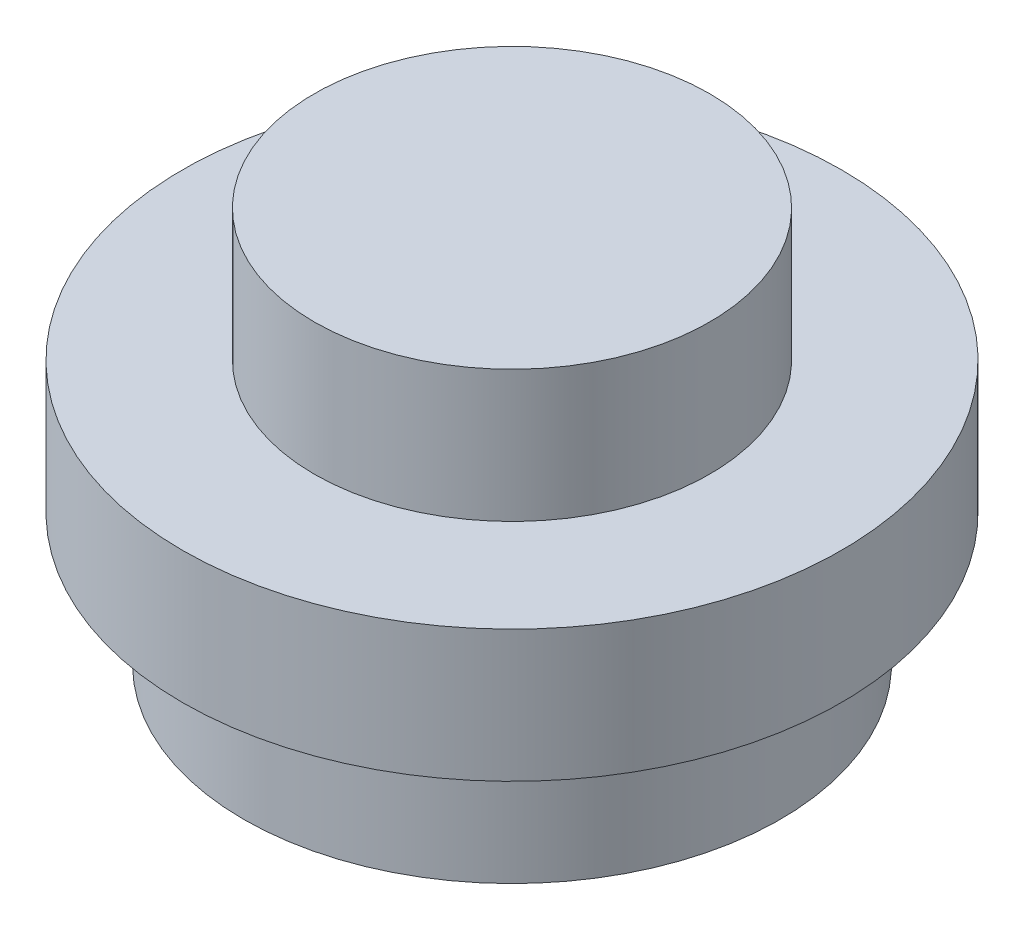
ISO-10303-21;
HEADER;
FILE_DESCRIPTION(('STEP AP214'),'2;1');
FILE_NAME('part.step','',(''),(''),'','','');
FILE_SCHEMA(('AUTOMOTIVE_DESIGN { 1 0 10303 214 1 1 1 1 }'));
ENDSEC;
DATA;
#1=APPLICATION_CONTEXT('core data for automotive mechanical design processes');
#2=APPLICATION_PROTOCOL_DEFINITION('international standard','automotive_design',2000,#1);
#3=PRODUCT_CONTEXT('',#1,'mechanical');
#4=PRODUCT('Part','Part','',(#3));
#5=PRODUCT_RELATED_PRODUCT_CATEGORY('part','',(#4));
#6=PRODUCT_DEFINITION_FORMATION('','',#4);
#7=PRODUCT_DEFINITION_CONTEXT('part definition',#1,'design');
#8=PRODUCT_DEFINITION('design','',#6,#7);
#9=PRODUCT_DEFINITION_SHAPE('','',#8);
#10=(LENGTH_UNIT() NAMED_UNIT(*) SI_UNIT(.MILLI.,.METRE.));
#11=(NAMED_UNIT(*) PLANE_ANGLE_UNIT() SI_UNIT($,.RADIAN.));
#12=(NAMED_UNIT(*) SI_UNIT($,.STERADIAN.) SOLID_ANGLE_UNIT());
#13=UNCERTAINTY_MEASURE_WITH_UNIT(LENGTH_MEASURE(1.E-05),#10,'distance_accuracy_value','');
#14=(GEOMETRIC_REPRESENTATION_CONTEXT(3) GLOBAL_UNCERTAINTY_ASSIGNED_CONTEXT((#13)) GLOBAL_UNIT_ASSIGNED_CONTEXT((#10,
#11,#12)) REPRESENTATION_CONTEXT('',''));
#15=CARTESIAN_POINT('',(0.,0.,0.));
#16=DIRECTION('',(0.,0.,1.));
#17=DIRECTION('',(1.,0.,0.));
#18=AXIS2_PLACEMENT_3D('',#15,#16,#17);
#19=CARTESIAN_POINT('',(0.,2.,0.));
#20=DIRECTION('',(0.,-1.,0.));
#21=DIRECTION('',(0.,0.,-1.));
#22=AXIS2_PLACEMENT_3D('',#19,#20,#21);
#23=CYLINDRICAL_SURFACE('',#22,1.5);
#24=CARTESIAN_POINT('',(0.,1.,0.));
#25=DIRECTION('',(0.,1.,0.));
#26=DIRECTION('',(0.,0.,1.));
#27=AXIS2_PLACEMENT_3D('',#24,#25,#26);
#28=CIRCLE('',#27,1.5);
#29=CARTESIAN_POINT('',(0.,1.,1.5));
#30=VERTEX_POINT('',#29);
#31=EDGE_CURVE('E43',#30,#30,#28,.T.);
#32=ORIENTED_EDGE('',*,*,#31,.T.);
#33=EDGE_LOOP('',(#32));
#34=FACE_BOUND('',#33,.T.);
#35=CARTESIAN_POINT('',(0.,2.,0.));
#36=DIRECTION('',(0.,1.,0.));
#37=DIRECTION('',(0.,0.,1.));
#38=AXIS2_PLACEMENT_3D('',#35,#36,#37);
#39=CIRCLE('',#38,1.5);
#40=CARTESIAN_POINT('',(0.,2.,1.5));
#41=VERTEX_POINT('',#40);
#42=EDGE_CURVE('E39',#41,#41,#39,.T.);
#43=ORIENTED_EDGE('',*,*,#42,.F.);
#44=EDGE_LOOP('',(#43));
#45=FACE_BOUND('',#44,.T.);
#46=ADVANCED_FACE('F33',(#34,#45),#23,.T.);
#47=CARTESIAN_POINT('',(0.,2.,0.));
#48=DIRECTION('',(0.,1.,0.));
#49=DIRECTION('',(0.,0.,1.));
#50=AXIS2_PLACEMENT_3D('',#47,#48,#49);
#51=PLANE('',#50);
#52=ORIENTED_EDGE('',*,*,#42,.T.);
#53=EDGE_LOOP('',(#52));
#54=FACE_BOUND('',#53,.T.);
#55=ADVANCED_FACE('F96',(#54),#51,.T.);
#56=CARTESIAN_POINT('',(0.,1.,0.));
#57=DIRECTION('',(0.,-1.,0.));
#58=DIRECTION('',(0.,0.,-1.));
#59=AXIS2_PLACEMENT_3D('',#56,#57,#58);
#60=CYLINDRICAL_SURFACE('',#59,2.5);
#61=CARTESIAN_POINT('',(0.,1.,0.));
#62=DIRECTION('',(0.,1.,0.));
#63=DIRECTION('',(0.,0.,1.));
#64=AXIS2_PLACEMENT_3D('',#61,#62,#63);
#65=CIRCLE('',#64,2.5);
#66=CARTESIAN_POINT('',(0.,1.,2.5));
#67=VERTEX_POINT('',#66);
#68=EDGE_CURVE('E48',#67,#67,#65,.T.);
#69=ORIENTED_EDGE('',*,*,#68,.F.);
#70=EDGE_LOOP('',(#69));
#71=FACE_BOUND('',#70,.T.);
#72=CARTESIAN_POINT('',(0.,0.,0.));
#73=DIRECTION('',(0.,1.,0.));
#74=DIRECTION('',(0.,0.,1.));
#75=AXIS2_PLACEMENT_3D('',#72,#73,#74);
#76=CIRCLE('',#75,2.5);
#77=CARTESIAN_POINT('',(0.,0.,2.5));
#78=VERTEX_POINT('',#77);
#79=EDGE_CURVE('E50',#78,#78,#76,.T.);
#80=ORIENTED_EDGE('',*,*,#79,.T.);
#81=EDGE_LOOP('',(#80));
#82=FACE_BOUND('',#81,.T.);
#83=ADVANCED_FACE('F101',(#71,#82),#60,.T.);
#84=CARTESIAN_POINT('',(0.,1.,0.));
#85=DIRECTION('',(0.,1.,0.));
#86=DIRECTION('',(0.,0.,1.));
#87=AXIS2_PLACEMENT_3D('',#84,#85,#86);
#88=PLANE('',#87);
#89=ORIENTED_EDGE('',*,*,#31,.F.);
#90=EDGE_LOOP('',(#89));
#91=FACE_BOUND('',#90,.T.);
#92=ORIENTED_EDGE('',*,*,#68,.T.);
#93=EDGE_LOOP('',(#92));
#94=FACE_BOUND('',#93,.T.);
#95=ADVANCED_FACE('F93',(#91,#94),#88,.T.);
#96=CARTESIAN_POINT('',(0.,0.,0.));
#97=DIRECTION('',(0.,1.,0.));
#98=DIRECTION('',(0.,0.,1.));
#99=AXIS2_PLACEMENT_3D('',#96,#97,#98);
#100=PLANE('',#99);
#101=CARTESIAN_POINT('',(0.,0.,0.));
#102=DIRECTION('',(0.,1.,0.));
#103=DIRECTION('',(0.,0.,1.));
#104=AXIS2_PLACEMENT_3D('',#101,#102,#103);
#105=CIRCLE('',#104,2.03553390593274);
#106=CARTESIAN_POINT('',(0.,0.,2.03553390593274));
#107=VERTEX_POINT('',#106);
#108=EDGE_CURVE('E56',#107,#107,#105,.T.);
#109=ORIENTED_EDGE('',*,*,#108,.T.);
#110=EDGE_LOOP('',(#109));
#111=FACE_BOUND('',#110,.T.);
#112=ORIENTED_EDGE('',*,*,#79,.F.);
#113=EDGE_LOOP('',(#112));
#114=FACE_BOUND('',#113,.T.);
#115=ADVANCED_FACE('F83',(#111,#114),#100,.F.);
#116=CARTESIAN_POINT('',(0.,-1.,0.));
#117=DIRECTION('',(0.,1.,0.));
#118=DIRECTION('',(0.,0.,1.));
#119=AXIS2_PLACEMENT_3D('',#116,#117,#118);
#120=CYLINDRICAL_SURFACE('',#119,1.5);
#121=CARTESIAN_POINT('',(0.,-1.,0.));
#122=DIRECTION('',(0.,1.,0.));
#123=DIRECTION('',(0.,0.,1.));
#124=AXIS2_PLACEMENT_3D('',#121,#122,#123);
#125=CIRCLE('',#124,1.5);
#126=CARTESIAN_POINT('',(0.,-1.,1.5));
#127=VERTEX_POINT('',#126);
#128=EDGE_CURVE('E59',#127,#127,#125,.T.);
#129=ORIENTED_EDGE('',*,*,#128,.F.);
#130=EDGE_LOOP('',(#129));
#131=FACE_BOUND('',#130,.T.);
#132=CARTESIAN_POINT('',(0.,0.,0.));
#133=DIRECTION('',(0.,1.,0.));
#134=DIRECTION('',(0.,0.,1.));
#135=AXIS2_PLACEMENT_3D('',#132,#133,#134);
#136=CIRCLE('',#135,1.5);
#137=CARTESIAN_POINT('',(0.,0.,1.5));
#138=VERTEX_POINT('',#137);
#139=EDGE_CURVE('E10',#138,#138,#136,.T.);
#140=ORIENTED_EDGE('',*,*,#139,.T.);
#141=EDGE_LOOP('',(#140));
#142=FACE_BOUND('',#141,.T.);
#143=ADVANCED_FACE('F92',(#131,#142),#120,.F.);
#144=CARTESIAN_POINT('',(0.,-1.,0.));
#145=DIRECTION('',(0.,1.,0.));
#146=DIRECTION('',(0.,0.,1.));
#147=AXIS2_PLACEMENT_3D('',#144,#145,#146);
#148=CYLINDRICAL_SURFACE('',#147,2.03553390593274);
#149=CARTESIAN_POINT('',(0.,-1.,0.));
#150=DIRECTION('',(0.,1.,0.));
#151=DIRECTION('',(0.,0.,1.));
#152=AXIS2_PLACEMENT_3D('',#149,#150,#151);
#153=CIRCLE('',#152,2.03553390593274);
#154=CARTESIAN_POINT('',(0.,-1.,2.03553390593274));
#155=VERTEX_POINT('',#154);
#156=EDGE_CURVE('E53',#155,#155,#153,.T.);
#157=ORIENTED_EDGE('',*,*,#156,.T.);
#158=EDGE_LOOP('',(#157));
#159=FACE_BOUND('',#158,.T.);
#160=ORIENTED_EDGE('',*,*,#108,.F.);
#161=EDGE_LOOP('',(#160));
#162=FACE_BOUND('',#161,.T.);
#163=ADVANCED_FACE('F87',(#159,#162),#148,.T.);
#164=CARTESIAN_POINT('',(0.,-1.,0.));
#165=DIRECTION('',(0.,1.,0.));
#166=DIRECTION('',(0.,0.,1.));
#167=AXIS2_PLACEMENT_3D('',#164,#165,#166);
#168=PLANE('',#167);
#169=ORIENTED_EDGE('',*,*,#128,.T.);
#170=EDGE_LOOP('',(#169));
#171=FACE_BOUND('',#170,.T.);
#172=ORIENTED_EDGE('',*,*,#156,.F.);
#173=EDGE_LOOP('',(#172));
#174=FACE_BOUND('',#173,.T.);
#175=ADVANCED_FACE('F82',(#171,#174),#168,.F.);
#176=CARTESIAN_POINT('',(0.,0.,0.));
#177=DIRECTION('',(0.,-1.,0.));
#178=DIRECTION('',(0.,0.,-1.));
#179=AXIS2_PLACEMENT_3D('',#176,#177,#178);
#180=CIRCLE('',#179,0.75);
#181=CARTESIAN_POINT('',(0.,0.,-0.75));
#182=VERTEX_POINT('',#181);
#183=EDGE_CURVE('E65',#182,#182,#180,.T.);
#184=ORIENTED_EDGE('',*,*,#183,.F.);
#185=EDGE_LOOP('',(#184));
#186=FACE_BOUND('',#185,.T.);
#187=ORIENTED_EDGE('',*,*,#139,.F.);
#188=EDGE_LOOP('',(#187));
#189=FACE_BOUND('',#188,.T.);
#190=ADVANCED_FACE('F76',(#186,#189),#100,.F.);
#191=CARTESIAN_POINT('',(0.,1.,0.));
#192=DIRECTION('',(0.,-1.,0.));
#193=DIRECTION('',(0.,0.,-1.));
#194=AXIS2_PLACEMENT_3D('',#191,#192,#193);
#195=CYLINDRICAL_SURFACE('',#194,0.75);
#196=CARTESIAN_POINT('',(0.,1.,0.));
#197=DIRECTION('',(0.,-1.,0.));
#198=DIRECTION('',(0.,0.,-1.));
#199=AXIS2_PLACEMENT_3D('',#196,#197,#198);
#200=CIRCLE('',#199,0.75);
#201=CARTESIAN_POINT('',(0.,1.,-0.75));
#202=VERTEX_POINT('',#201);
#203=EDGE_CURVE('E60',#202,#202,#200,.T.);
#204=ORIENTED_EDGE('',*,*,#203,.F.);
#205=EDGE_LOOP('',(#204));
#206=FACE_BOUND('',#205,.T.);
#207=ORIENTED_EDGE('',*,*,#183,.T.);
#208=EDGE_LOOP('',(#207));
#209=FACE_BOUND('',#208,.T.);
#210=ADVANCED_FACE('F73',(#206,#209),#195,.F.);
#211=CARTESIAN_POINT('',(0.,1.,0.));
#212=DIRECTION('',(0.,-1.,0.));
#213=DIRECTION('',(0.,0.,-1.));
#214=AXIS2_PLACEMENT_3D('',#211,#212,#213);
#215=PLANE('',#214);
#216=ORIENTED_EDGE('',*,*,#203,.T.);
#217=EDGE_LOOP('',(#216));
#218=FACE_BOUND('',#217,.T.);
#219=ADVANCED_FACE('F71',(#218),#215,.T.);
#220=CLOSED_SHELL('',(#46,#55,#83,#95,#115,#143,#163,#175,#190,#210,#219));
#221=MANIFOLD_SOLID_BREP('B2',#220);
#222=ADVANCED_BREP_SHAPE_REPRESENTATION('',(#18,#221),#14);
#223=SHAPE_DEFINITION_REPRESENTATION(#9,#222);
ENDSEC;
END-ISO-10303-21;
